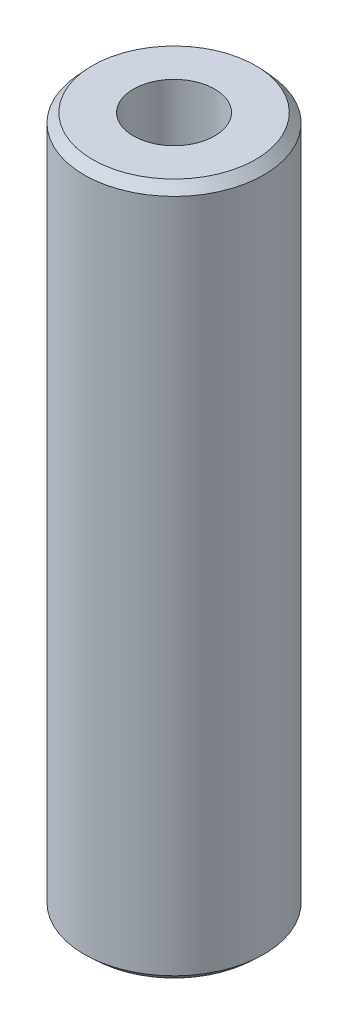
ISO-10303-21;
HEADER;
FILE_DESCRIPTION(('STEP AP214'),'2;1');
FILE_NAME('part.step','',(''),(''),'','','');
FILE_SCHEMA(('AUTOMOTIVE_DESIGN { 1 0 10303 214 1 1 1 1 }'));
ENDSEC;
DATA;
#1=APPLICATION_CONTEXT('core data for automotive mechanical design processes');
#2=APPLICATION_PROTOCOL_DEFINITION('international standard','automotive_design',2000,#1);
#3=PRODUCT_CONTEXT('',#1,'mechanical');
#4=PRODUCT('Part','Part','',(#3));
#5=PRODUCT_RELATED_PRODUCT_CATEGORY('part','',(#4));
#6=PRODUCT_DEFINITION_FORMATION('','',#4);
#7=PRODUCT_DEFINITION_CONTEXT('part definition',#1,'design');
#8=PRODUCT_DEFINITION('design','',#6,#7);
#9=PRODUCT_DEFINITION_SHAPE('','',#8);
#10=(LENGTH_UNIT() NAMED_UNIT(*) SI_UNIT(.MILLI.,.METRE.));
#11=(NAMED_UNIT(*) PLANE_ANGLE_UNIT() SI_UNIT($,.RADIAN.));
#12=(NAMED_UNIT(*) SI_UNIT($,.STERADIAN.) SOLID_ANGLE_UNIT());
#13=UNCERTAINTY_MEASURE_WITH_UNIT(LENGTH_MEASURE(1.E-05),#10,'distance_accuracy_value','');
#14=(GEOMETRIC_REPRESENTATION_CONTEXT(3) GLOBAL_UNCERTAINTY_ASSIGNED_CONTEXT((#13)) GLOBAL_UNIT_ASSIGNED_CONTEXT((#10,
#11,#12)) REPRESENTATION_CONTEXT('',''));
#15=CARTESIAN_POINT('',(0.,0.,0.));
#16=DIRECTION('',(0.,0.,1.));
#17=DIRECTION('',(1.,0.,0.));
#18=AXIS2_PLACEMENT_3D('',#15,#16,#17);
#19=CARTESIAN_POINT('',(0.,327.403839498098,0.));
#20=DIRECTION('',(0.,-1.,0.));
#21=DIRECTION('',(0.,0.,-1.));
#22=AXIS2_PLACEMENT_3D('',#19,#20,#21);
#23=CYLINDRICAL_SURFACE('',#22,42.5);
#24=CARTESIAN_POINT('',(0.,323.103495684799,0.));
#25=DIRECTION('',(0.,1.,0.));
#26=DIRECTION('',(0.,0.,1.));
#27=AXIS2_PLACEMENT_3D('',#24,#25,#26);
#28=CIRCLE('',#27,42.5);
#29=CARTESIAN_POINT('',(0.,323.103495684799,42.5));
#30=VERTEX_POINT('',#29);
#31=EDGE_CURVE('E50',#30,#30,#28,.F.);
#32=ORIENTED_EDGE('',*,*,#31,.T.);
#33=EDGE_LOOP('',(#32));
#34=FACE_BOUND('',#33,.T.);
#35=CARTESIAN_POINT('',(0.,3.96846072831925,0.));
#36=DIRECTION('',(0.,1.,0.));
#37=DIRECTION('',(0.,0.,1.));
#38=AXIS2_PLACEMENT_3D('',#35,#36,#37);
#39=CIRCLE('',#38,42.5);
#40=CARTESIAN_POINT('',(0.,3.96846072831925,42.5));
#41=VERTEX_POINT('',#40);
#42=EDGE_CURVE('E51',#41,#41,#39,.T.);
#43=ORIENTED_EDGE('',*,*,#42,.T.);
#44=EDGE_LOOP('',(#43));
#45=FACE_BOUND('',#44,.T.);
#46=ADVANCED_FACE('F39',(#34,#45),#23,.T.);
#47=CARTESIAN_POINT('',(0.,327.403839498098,0.));
#48=DIRECTION('',(0.,1.,0.));
#49=DIRECTION('',(0.,0.,1.));
#50=AXIS2_PLACEMENT_3D('',#47,#48,#49);
#51=PLANE('',#50);
#52=CARTESIAN_POINT('',(0.,327.403839498098,0.));
#53=DIRECTION('',(0.,1.,0.));
#54=DIRECTION('',(0.,0.,1.));
#55=AXIS2_PLACEMENT_3D('',#52,#53,#54);
#56=CIRCLE('',#55,38.5315392716806);
#57=CARTESIAN_POINT('',(0.,327.403839498098,38.5315392716806));
#58=VERTEX_POINT('',#57);
#59=EDGE_CURVE('E54',#58,#58,#56,.T.);
#60=ORIENTED_EDGE('',*,*,#59,.T.);
#61=EDGE_LOOP('',(#60));
#62=FACE_BOUND('',#61,.T.);
#63=CARTESIAN_POINT('',(0.,327.403839498098,0.));
#64=DIRECTION('',(0.,1.,0.));
#65=DIRECTION('',(0.,0.,1.));
#66=AXIS2_PLACEMENT_3D('',#63,#64,#65);
#67=CIRCLE('',#66,19.227600723454);
#68=CARTESIAN_POINT('',(0.,327.403839498098,19.227600723454));
#69=VERTEX_POINT('',#68);
#70=EDGE_CURVE('E58',#69,#69,#67,.T.);
#71=ORIENTED_EDGE('',*,*,#70,.F.);
#72=EDGE_LOOP('',(#71));
#73=FACE_BOUND('',#72,.T.);
#74=ADVANCED_FACE('F69',(#62,#73),#51,.T.);
#75=CARTESIAN_POINT('',(0.,0.,0.));
#76=DIRECTION('',(0.,1.,0.));
#77=DIRECTION('',(0.,0.,1.));
#78=AXIS2_PLACEMENT_3D('',#75,#76,#77);
#79=PLANE('',#78);
#80=CARTESIAN_POINT('',(0.,0.,0.));
#81=DIRECTION('',(0.,1.,0.));
#82=DIRECTION('',(0.,0.,1.));
#83=AXIS2_PLACEMENT_3D('',#80,#81,#82);
#84=CIRCLE('',#83,38.1996561867017);
#85=CARTESIAN_POINT('',(0.,0.,38.1996561867017));
#86=VERTEX_POINT('',#85);
#87=EDGE_CURVE('E10',#86,#86,#84,.F.);
#88=ORIENTED_EDGE('',*,*,#87,.T.);
#89=EDGE_LOOP('',(#88));
#90=FACE_BOUND('',#89,.T.);
#91=CARTESIAN_POINT('',(0.,0.,0.));
#92=DIRECTION('',(0.,1.,0.));
#93=DIRECTION('',(0.,0.,1.));
#94=AXIS2_PLACEMENT_3D('',#91,#92,#93);
#95=CIRCLE('',#94,19.227600723454);
#96=CARTESIAN_POINT('',(0.,0.,19.227600723454));
#97=VERTEX_POINT('',#96);
#98=EDGE_CURVE('E63',#97,#97,#95,.T.);
#99=ORIENTED_EDGE('',*,*,#98,.T.);
#100=EDGE_LOOP('',(#99));
#101=FACE_BOUND('',#100,.T.);
#102=ADVANCED_FACE('F75',(#90,#101),#79,.F.);
#103=CARTESIAN_POINT('',(0.,327.403839498098,0.));
#104=DIRECTION('',(0.,-1.,0.));
#105=DIRECTION('',(0.,0.,-1.));
#106=AXIS2_PLACEMENT_3D('',#103,#104,#105);
#107=CYLINDRICAL_SURFACE('',#106,19.227600723454);
#108=ORIENTED_EDGE('',*,*,#70,.T.);
#109=EDGE_LOOP('',(#108));
#110=FACE_BOUND('',#109,.T.);
#111=ORIENTED_EDGE('',*,*,#98,.F.);
#112=EDGE_LOOP('',(#111));
#113=FACE_BOUND('',#112,.T.);
#114=ADVANCED_FACE('F70',(#110,#113),#107,.F.);
#115=CARTESIAN_POINT('',(0.,327.403839498098,0.));
#116=DIRECTION('',(0.,-1.,0.));
#117=DIRECTION('',(0.,0.,-1.));
#118=AXIS2_PLACEMENT_3D('',#115,#116,#117);
#119=CONICAL_SURFACE('',#118,38.5315392716806,0.745282928048871);
#120=ORIENTED_EDGE('',*,*,#31,.F.);
#121=EDGE_LOOP('',(#120));
#122=FACE_BOUND('',#121,.T.);
#123=ORIENTED_EDGE('',*,*,#59,.F.);
#124=EDGE_LOOP('',(#123));
#125=FACE_BOUND('',#124,.T.);
#126=ADVANCED_FACE('F81',(#122,#125),#119,.T.);
#127=CARTESIAN_POINT('',(0.,3.96846072831925,0.));
#128=DIRECTION('',(0.,1.,0.));
#129=DIRECTION('',(0.,0.,1.));
#130=AXIS2_PLACEMENT_3D('',#127,#128,#129);
#131=CONICAL_SURFACE('',#130,42.5,0.825513398746031);
#132=ORIENTED_EDGE('',*,*,#87,.F.);
#133=EDGE_LOOP('',(#132));
#134=FACE_BOUND('',#133,.T.);
#135=ORIENTED_EDGE('',*,*,#42,.F.);
#136=EDGE_LOOP('',(#135));
#137=FACE_BOUND('',#136,.T.);
#138=ADVANCED_FACE('F45',(#134,#137),#131,.T.);
#139=CLOSED_SHELL('',(#46,#74,#102,#114,#126,#138));
#140=MANIFOLD_SOLID_BREP('B2',#139);
#141=ADVANCED_BREP_SHAPE_REPRESENTATION('',(#18,#140),#14);
#142=SHAPE_DEFINITION_REPRESENTATION(#9,#141);
ENDSEC;
END-ISO-10303-21;
